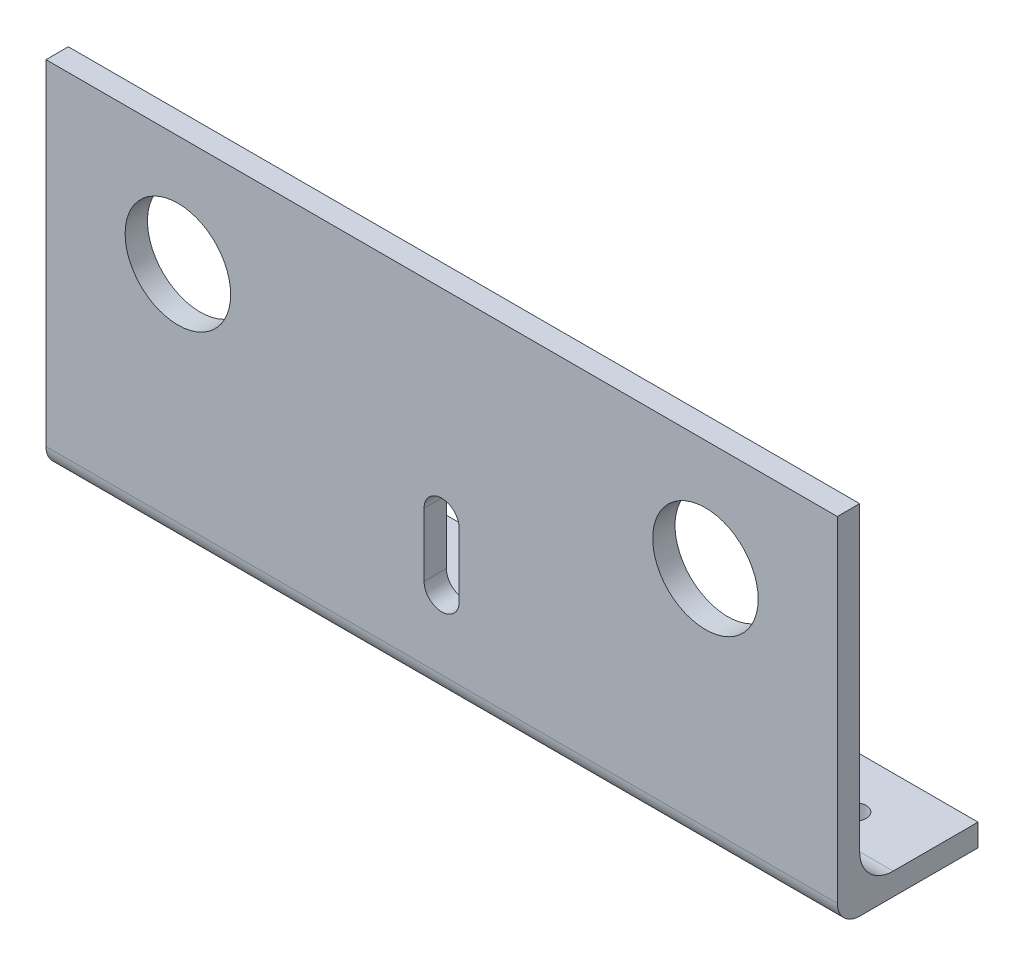
ISO-10303-21;
HEADER;
FILE_DESCRIPTION(('STEP AP214'),'2;1');
FILE_NAME('part.step','',(''),(''),'','','');
FILE_SCHEMA(('AUTOMOTIVE_DESIGN { 1 0 10303 214 1 1 1 1 }'));
ENDSEC;
DATA;
#1=APPLICATION_CONTEXT('core data for automotive mechanical design processes');
#2=APPLICATION_PROTOCOL_DEFINITION('international standard','automotive_design',2000,#1);
#3=PRODUCT_CONTEXT('',#1,'mechanical');
#4=PRODUCT('Part','Part','',(#3));
#5=PRODUCT_RELATED_PRODUCT_CATEGORY('part','',(#4));
#6=PRODUCT_DEFINITION_FORMATION('','',#4);
#7=PRODUCT_DEFINITION_CONTEXT('part definition',#1,'design');
#8=PRODUCT_DEFINITION('design','',#6,#7);
#9=PRODUCT_DEFINITION_SHAPE('','',#8);
#10=(LENGTH_UNIT() NAMED_UNIT(*) SI_UNIT(.MILLI.,.METRE.));
#11=(NAMED_UNIT(*) PLANE_ANGLE_UNIT() SI_UNIT($,.RADIAN.));
#12=(NAMED_UNIT(*) SI_UNIT($,.STERADIAN.) SOLID_ANGLE_UNIT());
#13=UNCERTAINTY_MEASURE_WITH_UNIT(LENGTH_MEASURE(1.E-05),#10,'distance_accuracy_value','');
#14=(GEOMETRIC_REPRESENTATION_CONTEXT(3) GLOBAL_UNCERTAINTY_ASSIGNED_CONTEXT((#13)) GLOBAL_UNIT_ASSIGNED_CONTEXT((#10,
#11,#12)) REPRESENTATION_CONTEXT('',''));
#15=CARTESIAN_POINT('',(0.,0.,0.));
#16=DIRECTION('',(0.,0.,1.));
#17=DIRECTION('',(1.,0.,0.));
#18=AXIS2_PLACEMENT_3D('',#15,#16,#17);
#19=CARTESIAN_POINT('',(225.,0.,-40.));
#20=DIRECTION('',(0.,1.,0.));
#21=DIRECTION('',(0.,0.,1.));
#22=AXIS2_PLACEMENT_3D('',#19,#20,#21);
#23=PLANE('',#22);
#24=CARTESIAN_POINT('',(20.,0.,-25.));
#25=DIRECTION('',(0.,-1.,0.));
#26=DIRECTION('',(0.,0.,-1.));
#27=AXIS2_PLACEMENT_3D('',#24,#25,#26);
#28=CIRCLE('',#27,3.19999999999999);
#29=CARTESIAN_POINT('',(20.,0.,-28.2));
#30=VERTEX_POINT('',#29);
#31=EDGE_CURVE('E494',#30,#30,#28,.T.);
#32=ORIENTED_EDGE('',*,*,#31,.F.);
#33=EDGE_LOOP('',(#32));
#34=FACE_BOUND('',#33,.T.);
#35=CARTESIAN_POINT('',(70.,0.,-25.));
#36=DIRECTION('',(0.,-1.,0.));
#37=DIRECTION('',(0.,0.,-1.));
#38=AXIS2_PLACEMENT_3D('',#35,#36,#37);
#39=CIRCLE('',#38,3.19999999999998);
#40=CARTESIAN_POINT('',(70.,0.,-28.2));
#41=VERTEX_POINT('',#40);
#42=EDGE_CURVE('E499',#41,#41,#39,.T.);
#43=ORIENTED_EDGE('',*,*,#42,.F.);
#44=EDGE_LOOP('',(#43));
#45=FACE_BOUND('',#44,.T.);
#46=CARTESIAN_POINT('',(155.,0.,-25.));
#47=DIRECTION('',(0.,-1.,0.));
#48=DIRECTION('',(0.,0.,-1.));
#49=AXIS2_PLACEMENT_3D('',#46,#47,#48);
#50=CIRCLE('',#49,3.19999999999998);
#51=CARTESIAN_POINT('',(155.,0.,-28.2));
#52=VERTEX_POINT('',#51);
#53=EDGE_CURVE('E511',#52,#52,#50,.T.);
#54=ORIENTED_EDGE('',*,*,#53,.F.);
#55=EDGE_LOOP('',(#54));
#56=FACE_BOUND('',#55,.T.);
#57=CARTESIAN_POINT('',(205.,0.,-25.));
#58=DIRECTION('',(0.,-1.,0.));
#59=DIRECTION('',(0.,0.,-1.));
#60=AXIS2_PLACEMENT_3D('',#57,#58,#59);
#61=CIRCLE('',#60,3.19999999999998);
#62=CARTESIAN_POINT('',(205.,0.,-28.2));
#63=VERTEX_POINT('',#62);
#64=EDGE_CURVE('E519',#63,#63,#61,.T.);
#65=ORIENTED_EDGE('',*,*,#64,.F.);
#66=EDGE_LOOP('',(#65));
#67=FACE_BOUND('',#66,.T.);
#68=DIRECTION('',(0.,0.,-1.));
#69=VECTOR('',#68,1.);
#70=CARTESIAN_POINT('',(225.,0.,-40.));
#71=LINE('',#70,#69);
#72=CARTESIAN_POINT('',(225.,0.,-6.35));
#73=VERTEX_POINT('',#72);
#74=CARTESIAN_POINT('',(225.,0.,-40.));
#75=VERTEX_POINT('',#74);
#76=EDGE_CURVE('E182',#73,#75,#71,.T.);
#77=ORIENTED_EDGE('',*,*,#76,.F.);
#78=DIRECTION('',(-1.,0.,0.));
#79=VECTOR('',#78,1.);
#80=CARTESIAN_POINT('',(225.,0.,-6.35));
#81=LINE('',#80,#79);
#82=CARTESIAN_POINT('',(0.,0.,-6.35));
#83=VERTEX_POINT('',#82);
#84=EDGE_CURVE('E249',#73,#83,#81,.T.);
#85=ORIENTED_EDGE('',*,*,#84,.T.);
#86=DIRECTION('',(0.,0.,-1.));
#87=VECTOR('',#86,1.);
#88=CARTESIAN_POINT('',(0.,0.,-40.));
#89=LINE('',#88,#87);
#90=CARTESIAN_POINT('',(0.,0.,-40.));
#91=VERTEX_POINT('',#90);
#92=EDGE_CURVE('E181',#83,#91,#89,.T.);
#93=ORIENTED_EDGE('',*,*,#92,.T.);
#94=DIRECTION('',(-1.,0.,0.));
#95=VECTOR('',#94,1.);
#96=CARTESIAN_POINT('',(225.,0.,-40.));
#97=LINE('',#96,#95);
#98=EDGE_CURVE('E245',#75,#91,#97,.T.);
#99=ORIENTED_EDGE('',*,*,#98,.F.);
#100=EDGE_LOOP('',(#77,#85,#93,#99));
#101=FACE_BOUND('',#100,.T.);
#102=ADVANCED_FACE('F39',(#34,#45,#56,#67,#101),#23,.F.);
#103=CARTESIAN_POINT('',(225.,6.35,-40.));
#104=DIRECTION('',(0.,0.,1.));
#105=DIRECTION('',(1.,0.,0.));
#106=AXIS2_PLACEMENT_3D('',#103,#104,#105);
#107=PLANE('',#106);
#108=DIRECTION('',(0.,1.,0.));
#109=VECTOR('',#108,1.);
#110=CARTESIAN_POINT('',(0.,6.35,-40.));
#111=LINE('',#110,#109);
#112=CARTESIAN_POINT('',(0.,6.35,-40.));
#113=VERTEX_POINT('',#112);
#114=EDGE_CURVE('E208',#91,#113,#111,.T.);
#115=ORIENTED_EDGE('',*,*,#114,.T.);
#116=DIRECTION('',(-1.,0.,0.));
#117=VECTOR('',#116,1.);
#118=CARTESIAN_POINT('',(225.,6.35,-40.));
#119=LINE('',#118,#117);
#120=CARTESIAN_POINT('',(225.,6.35,-40.));
#121=VERTEX_POINT('',#120);
#122=EDGE_CURVE('E241',#121,#113,#119,.T.);
#123=ORIENTED_EDGE('',*,*,#122,.F.);
#124=DIRECTION('',(0.,1.,0.));
#125=VECTOR('',#124,1.);
#126=CARTESIAN_POINT('',(225.,6.35,-40.));
#127=LINE('',#126,#125);
#128=EDGE_CURVE('E185',#75,#121,#127,.T.);
#129=ORIENTED_EDGE('',*,*,#128,.F.);
#130=ORIENTED_EDGE('',*,*,#98,.T.);
#131=EDGE_LOOP('',(#115,#123,#129,#130));
#132=FACE_BOUND('',#131,.T.);
#133=ADVANCED_FACE('F289',(#132),#107,.F.);
#134=CARTESIAN_POINT('',(225.,6.35,-15.875));
#135=DIRECTION('',(0.,-1.,0.));
#136=DIRECTION('',(0.,0.,-1.));
#137=AXIS2_PLACEMENT_3D('',#134,#135,#136);
#138=PLANE('',#137);
#139=CARTESIAN_POINT('',(20.,6.35,-25.));
#140=DIRECTION('',(0.,-1.,0.));
#141=DIRECTION('',(0.,0.,-1.));
#142=AXIS2_PLACEMENT_3D('',#139,#140,#141);
#143=CIRCLE('',#142,3.19999999999998);
#144=CARTESIAN_POINT('',(20.,6.35,-28.2));
#145=VERTEX_POINT('',#144);
#146=EDGE_CURVE('E497',#145,#145,#143,.T.);
#147=ORIENTED_EDGE('',*,*,#146,.T.);
#148=EDGE_LOOP('',(#147));
#149=FACE_BOUND('',#148,.T.);
#150=CARTESIAN_POINT('',(70.,6.35,-25.));
#151=DIRECTION('',(0.,-1.,0.));
#152=DIRECTION('',(0.,0.,-1.));
#153=AXIS2_PLACEMENT_3D('',#150,#151,#152);
#154=CIRCLE('',#153,3.19999999999998);
#155=CARTESIAN_POINT('',(70.,6.35,-28.2));
#156=VERTEX_POINT('',#155);
#157=EDGE_CURVE('E504',#156,#156,#154,.T.);
#158=ORIENTED_EDGE('',*,*,#157,.T.);
#159=EDGE_LOOP('',(#158));
#160=FACE_BOUND('',#159,.T.);
#161=CARTESIAN_POINT('',(155.,6.35,-25.));
#162=DIRECTION('',(0.,-1.,0.));
#163=DIRECTION('',(0.,0.,-1.));
#164=AXIS2_PLACEMENT_3D('',#161,#162,#163);
#165=CIRCLE('',#164,3.19999999999998);
#166=CARTESIAN_POINT('',(155.,6.35,-28.2));
#167=VERTEX_POINT('',#166);
#168=EDGE_CURVE('E515',#167,#167,#165,.T.);
#169=ORIENTED_EDGE('',*,*,#168,.T.);
#170=EDGE_LOOP('',(#169));
#171=FACE_BOUND('',#170,.T.);
#172=CARTESIAN_POINT('',(205.,6.35,-25.));
#173=DIRECTION('',(0.,-1.,0.));
#174=DIRECTION('',(0.,0.,-1.));
#175=AXIS2_PLACEMENT_3D('',#172,#173,#174);
#176=CIRCLE('',#175,3.19999999999998);
#177=CARTESIAN_POINT('',(205.,6.35,-28.2));
#178=VERTEX_POINT('',#177);
#179=EDGE_CURVE('E43',#178,#178,#176,.T.);
#180=ORIENTED_EDGE('',*,*,#179,.T.);
#181=EDGE_LOOP('',(#180));
#182=FACE_BOUND('',#181,.T.);
#183=DIRECTION('',(0.,0.,1.));
#184=VECTOR('',#183,1.);
#185=CARTESIAN_POINT('',(0.,6.35,-15.875));
#186=LINE('',#185,#184);
#187=CARTESIAN_POINT('',(0.,6.35,-15.875));
#188=VERTEX_POINT('',#187);
#189=EDGE_CURVE('E211',#113,#188,#186,.T.);
#190=ORIENTED_EDGE('',*,*,#189,.T.);
#191=DIRECTION('',(-1.,0.,0.));
#192=VECTOR('',#191,1.);
#193=CARTESIAN_POINT('',(225.,6.35,-15.875));
#194=LINE('',#193,#192);
#195=CARTESIAN_POINT('',(225.,6.35,-15.875));
#196=VERTEX_POINT('',#195);
#197=EDGE_CURVE('E237',#196,#188,#194,.T.);
#198=ORIENTED_EDGE('',*,*,#197,.F.);
#199=DIRECTION('',(0.,0.,1.));
#200=VECTOR('',#199,1.);
#201=CARTESIAN_POINT('',(225.,6.35,-15.875));
#202=LINE('',#201,#200);
#203=EDGE_CURVE('E189',#121,#196,#202,.T.);
#204=ORIENTED_EDGE('',*,*,#203,.F.);
#205=ORIENTED_EDGE('',*,*,#122,.T.);
#206=EDGE_LOOP('',(#190,#198,#204,#205));
#207=FACE_BOUND('',#206,.T.);
#208=ADVANCED_FACE('F294',(#149,#160,#171,#182,#207),#138,.F.);
#209=CARTESIAN_POINT('',(225.,15.875,-15.875));
#210=DIRECTION('',(-1.,0.,0.));
#211=DIRECTION('',(0.,0.,1.));
#212=AXIS2_PLACEMENT_3D('',#209,#210,#211);
#213=CYLINDRICAL_SURFACE('',#212,9.525);
#214=CARTESIAN_POINT('',(0.,15.875,-15.875));
#215=DIRECTION('',(-1.,0.,0.));
#216=DIRECTION('',(0.,0.,-1.));
#217=AXIS2_PLACEMENT_3D('',#214,#215,#216);
#218=CIRCLE('',#217,9.525);
#219=CARTESIAN_POINT('',(0.,15.875,-6.35));
#220=VERTEX_POINT('',#219);
#221=EDGE_CURVE('E214',#188,#220,#218,.T.);
#222=ORIENTED_EDGE('',*,*,#221,.T.);
#223=DIRECTION('',(-1.,0.,0.));
#224=VECTOR('',#223,1.);
#225=CARTESIAN_POINT('',(225.,15.875,-6.35));
#226=LINE('',#225,#224);
#227=CARTESIAN_POINT('',(225.,15.875,-6.35));
#228=VERTEX_POINT('',#227);
#229=EDGE_CURVE('E233',#228,#220,#226,.T.);
#230=ORIENTED_EDGE('',*,*,#229,.F.);
#231=CARTESIAN_POINT('',(225.,15.875,-15.875));
#232=DIRECTION('',(-1.,0.,0.));
#233=DIRECTION('',(0.,0.,-1.));
#234=AXIS2_PLACEMENT_3D('',#231,#232,#233);
#235=CIRCLE('',#234,9.525);
#236=EDGE_CURVE('E192',#196,#228,#235,.T.);
#237=ORIENTED_EDGE('',*,*,#236,.F.);
#238=ORIENTED_EDGE('',*,*,#197,.T.);
#239=EDGE_LOOP('',(#222,#230,#237,#238));
#240=FACE_BOUND('',#239,.T.);
#241=ADVANCED_FACE('F302',(#240),#213,.F.);
#242=CARTESIAN_POINT('',(225.,101.6,-6.35));
#243=DIRECTION('',(0.,0.,1.));
#244=DIRECTION('',(1.,0.,0.));
#245=AXIS2_PLACEMENT_3D('',#242,#243,#244);
#246=PLANE('',#245);
#247=DIRECTION('',(0.,-1.,0.));
#248=VECTOR('',#247,1.);
#249=CARTESIAN_POINT('',(117.5,44.875,-6.35));
#250=LINE('',#249,#248);
#251=CARTESIAN_POINT('',(117.5,44.875,-6.35));
#252=VERTEX_POINT('',#251);
#253=CARTESIAN_POINT('',(117.5,26.875,-6.35));
#254=VERTEX_POINT('',#253);
#255=EDGE_CURVE('E143',#252,#254,#250,.T.);
#256=ORIENTED_EDGE('',*,*,#255,.F.);
#257=CARTESIAN_POINT('',(112.5,44.875,-6.35));
#258=DIRECTION('',(0.,0.,-1.));
#259=DIRECTION('',(-1.,0.,0.));
#260=AXIS2_PLACEMENT_3D('',#257,#258,#259);
#261=CIRCLE('',#260,4.99999999999999);
#262=CARTESIAN_POINT('',(107.5,44.875,-6.35));
#263=VERTEX_POINT('',#262);
#264=EDGE_CURVE('E56',#263,#252,#261,.T.);
#265=ORIENTED_EDGE('',*,*,#264,.F.);
#266=DIRECTION('',(0.,1.,0.));
#267=VECTOR('',#266,1.);
#268=CARTESIAN_POINT('',(107.5,44.875,-6.35));
#269=LINE('',#268,#267);
#270=CARTESIAN_POINT('',(107.5,26.875,-6.35));
#271=VERTEX_POINT('',#270);
#272=EDGE_CURVE('E151',#271,#263,#269,.T.);
#273=ORIENTED_EDGE('',*,*,#272,.F.);
#274=CARTESIAN_POINT('',(112.5,26.875,-6.35));
#275=DIRECTION('',(0.,0.,-1.));
#276=DIRECTION('',(-1.,0.,0.));
#277=AXIS2_PLACEMENT_3D('',#274,#275,#276);
#278=CIRCLE('',#277,5.);
#279=EDGE_CURVE('E133',#254,#271,#278,.T.);
#280=ORIENTED_EDGE('',*,*,#279,.F.);
#281=EDGE_LOOP('',(#256,#265,#273,#280));
#282=FACE_BOUND('',#281,.T.);
#283=CARTESIAN_POINT('',(37.5,70.,-6.34999999999999));
#284=DIRECTION('',(0.,0.,1.));
#285=DIRECTION('',(1.,0.,0.));
#286=AXIS2_PLACEMENT_3D('',#283,#284,#285);
#287=CIRCLE('',#286,15.);
#288=CARTESIAN_POINT('',(52.5,70.,-6.34999999999999));
#289=VERTEX_POINT('',#288);
#290=EDGE_CURVE('E177',#289,#289,#287,.F.);
#291=ORIENTED_EDGE('',*,*,#290,.F.);
#292=EDGE_LOOP('',(#291));
#293=FACE_BOUND('',#292,.T.);
#294=CARTESIAN_POINT('',(187.5,70.,-6.34999999999999));
#295=DIRECTION('',(0.,0.,1.));
#296=DIRECTION('',(1.,0.,0.));
#297=AXIS2_PLACEMENT_3D('',#294,#295,#296);
#298=CIRCLE('',#297,15.);
#299=CARTESIAN_POINT('',(202.5,70.,-6.34999999999999));
#300=VERTEX_POINT('',#299);
#301=EDGE_CURVE('E170',#300,#300,#298,.F.);
#302=ORIENTED_EDGE('',*,*,#301,.F.);
#303=EDGE_LOOP('',(#302));
#304=FACE_BOUND('',#303,.T.);
#305=DIRECTION('',(0.,1.,0.));
#306=VECTOR('',#305,1.);
#307=CARTESIAN_POINT('',(0.,101.6,-6.35));
#308=LINE('',#307,#306);
#309=CARTESIAN_POINT('',(0.,101.6,-6.35));
#310=VERTEX_POINT('',#309);
#311=EDGE_CURVE('E217',#220,#310,#308,.T.);
#312=ORIENTED_EDGE('',*,*,#311,.T.);
#313=DIRECTION('',(-1.,0.,0.));
#314=VECTOR('',#313,1.);
#315=CARTESIAN_POINT('',(225.,101.6,-6.35));
#316=LINE('',#315,#314);
#317=CARTESIAN_POINT('',(225.,101.6,-6.35));
#318=VERTEX_POINT('',#317);
#319=EDGE_CURVE('E229',#318,#310,#316,.T.);
#320=ORIENTED_EDGE('',*,*,#319,.F.);
#321=DIRECTION('',(0.,1.,0.));
#322=VECTOR('',#321,1.);
#323=CARTESIAN_POINT('',(225.,101.6,-6.35));
#324=LINE('',#323,#322);
#325=EDGE_CURVE('E195',#228,#318,#324,.T.);
#326=ORIENTED_EDGE('',*,*,#325,.F.);
#327=ORIENTED_EDGE('',*,*,#229,.T.);
#328=EDGE_LOOP('',(#312,#320,#326,#327));
#329=FACE_BOUND('',#328,.T.);
#330=ADVANCED_FACE('F148',(#282,#293,#304,#329),#246,.F.);
#331=CARTESIAN_POINT('',(225.,101.6,0.));
#332=DIRECTION('',(0.,-1.,0.));
#333=DIRECTION('',(0.,0.,-1.));
#334=AXIS2_PLACEMENT_3D('',#331,#332,#333);
#335=PLANE('',#334);
#336=DIRECTION('',(0.,0.,1.));
#337=VECTOR('',#336,1.);
#338=CARTESIAN_POINT('',(0.,101.6,0.));
#339=LINE('',#338,#337);
#340=CARTESIAN_POINT('',(0.,101.6,0.));
#341=VERTEX_POINT('',#340);
#342=EDGE_CURVE('E220',#310,#341,#339,.T.);
#343=ORIENTED_EDGE('',*,*,#342,.T.);
#344=DIRECTION('',(-1.,0.,0.));
#345=VECTOR('',#344,1.);
#346=CARTESIAN_POINT('',(225.,101.6,0.));
#347=LINE('',#346,#345);
#348=CARTESIAN_POINT('',(225.,101.6,0.));
#349=VERTEX_POINT('',#348);
#350=EDGE_CURVE('E205',#349,#341,#347,.T.);
#351=ORIENTED_EDGE('',*,*,#350,.F.);
#352=DIRECTION('',(0.,0.,1.));
#353=VECTOR('',#352,1.);
#354=CARTESIAN_POINT('',(225.,101.6,0.));
#355=LINE('',#354,#353);
#356=EDGE_CURVE('E198',#318,#349,#355,.T.);
#357=ORIENTED_EDGE('',*,*,#356,.F.);
#358=ORIENTED_EDGE('',*,*,#319,.T.);
#359=EDGE_LOOP('',(#343,#351,#357,#358));
#360=FACE_BOUND('',#359,.T.);
#361=ADVANCED_FACE('F309',(#360),#335,.F.);
#362=CARTESIAN_POINT('',(225.,0.,0.));
#363=DIRECTION('',(0.,0.,-1.));
#364=DIRECTION('',(-1.,0.,0.));
#365=AXIS2_PLACEMENT_3D('',#362,#363,#364);
#366=PLANE('',#365);
#367=DIRECTION('',(0.,1.,0.));
#368=VECTOR('',#367,1.);
#369=CARTESIAN_POINT('',(107.5,0.,0.));
#370=LINE('',#369,#368);
#371=CARTESIAN_POINT('',(107.5,26.875,0.));
#372=VERTEX_POINT('',#371);
#373=CARTESIAN_POINT('',(107.5,44.875,0.));
#374=VERTEX_POINT('',#373);
#375=EDGE_CURVE('E49',#372,#374,#370,.T.);
#376=ORIENTED_EDGE('',*,*,#375,.T.);
#377=CARTESIAN_POINT('',(112.5,44.875,0.));
#378=DIRECTION('',(0.,0.,-1.));
#379=DIRECTION('',(-1.,0.,0.));
#380=AXIS2_PLACEMENT_3D('',#377,#378,#379);
#381=CIRCLE('',#380,4.99999999999999);
#382=CARTESIAN_POINT('',(117.5,44.875,0.));
#383=VERTEX_POINT('',#382);
#384=EDGE_CURVE('E11',#374,#383,#381,.T.);
#385=ORIENTED_EDGE('',*,*,#384,.T.);
#386=DIRECTION('',(0.,-1.,0.));
#387=VECTOR('',#386,1.);
#388=CARTESIAN_POINT('',(117.5,0.,0.));
#389=LINE('',#388,#387);
#390=CARTESIAN_POINT('',(117.5,26.875,0.));
#391=VERTEX_POINT('',#390);
#392=EDGE_CURVE('E262',#383,#391,#389,.T.);
#393=ORIENTED_EDGE('',*,*,#392,.T.);
#394=CARTESIAN_POINT('',(112.5,26.875,0.));
#395=DIRECTION('',(0.,0.,-1.));
#396=DIRECTION('',(-1.,0.,0.));
#397=AXIS2_PLACEMENT_3D('',#394,#395,#396);
#398=CIRCLE('',#397,5.);
#399=EDGE_CURVE('E136',#391,#372,#398,.T.);
#400=ORIENTED_EDGE('',*,*,#399,.T.);
#401=EDGE_LOOP('',(#376,#385,#393,#400));
#402=FACE_BOUND('',#401,.T.);
#403=CARTESIAN_POINT('',(37.5,70.,0.));
#404=DIRECTION('',(0.,0.,-1.));
#405=DIRECTION('',(-1.,0.,0.));
#406=AXIS2_PLACEMENT_3D('',#403,#404,#405);
#407=CIRCLE('',#406,15.);
#408=CARTESIAN_POINT('',(22.5,70.,0.));
#409=VERTEX_POINT('',#408);
#410=EDGE_CURVE('E166',#409,#409,#407,.T.);
#411=ORIENTED_EDGE('',*,*,#410,.T.);
#412=EDGE_LOOP('',(#411));
#413=FACE_BOUND('',#412,.T.);
#414=CARTESIAN_POINT('',(187.5,70.,0.));
#415=DIRECTION('',(0.,0.,-1.));
#416=DIRECTION('',(1.,0.,0.));
#417=AXIS2_PLACEMENT_3D('',#414,#415,#416);
#418=CIRCLE('',#417,15.);
#419=CARTESIAN_POINT('',(202.5,70.,0.));
#420=VERTEX_POINT('',#419);
#421=EDGE_CURVE('E161',#420,#420,#418,.T.);
#422=ORIENTED_EDGE('',*,*,#421,.T.);
#423=EDGE_LOOP('',(#422));
#424=FACE_BOUND('',#423,.T.);
#425=DIRECTION('',(0.,-1.,0.));
#426=VECTOR('',#425,1.);
#427=CARTESIAN_POINT('',(0.,0.,0.));
#428=LINE('',#427,#426);
#429=CARTESIAN_POINT('',(0.,6.35,0.));
#430=VERTEX_POINT('',#429);
#431=EDGE_CURVE('E186',#341,#430,#428,.T.);
#432=ORIENTED_EDGE('',*,*,#431,.T.);
#433=DIRECTION('',(-1.,0.,0.));
#434=VECTOR('',#433,1.);
#435=CARTESIAN_POINT('',(225.,6.35,0.));
#436=LINE('',#435,#434);
#437=CARTESIAN_POINT('',(225.,6.35,0.));
#438=VERTEX_POINT('',#437);
#439=EDGE_CURVE('E256',#430,#438,#436,.F.);
#440=ORIENTED_EDGE('',*,*,#439,.T.);
#441=DIRECTION('',(0.,-1.,0.));
#442=VECTOR('',#441,1.);
#443=CARTESIAN_POINT('',(225.,0.,0.));
#444=LINE('',#443,#442);
#445=EDGE_CURVE('E201',#349,#438,#444,.T.);
#446=ORIENTED_EDGE('',*,*,#445,.F.);
#447=ORIENTED_EDGE('',*,*,#350,.T.);
#448=EDGE_LOOP('',(#432,#440,#446,#447));
#449=FACE_BOUND('',#448,.T.);
#450=ADVANCED_FACE('F270',(#402,#413,#424,#449),#366,.F.);
#451=CARTESIAN_POINT('',(225.,15.875,-15.875));
#452=DIRECTION('',(1.,0.,0.));
#453=DIRECTION('',(0.,0.,-1.));
#454=AXIS2_PLACEMENT_3D('',#451,#452,#453);
#455=PLANE('',#454);
#456=ORIENTED_EDGE('',*,*,#445,.T.);
#457=CARTESIAN_POINT('',(225.,6.35,-6.35));
#458=DIRECTION('',(1.,0.,0.));
#459=DIRECTION('',(0.,0.,-1.));
#460=AXIS2_PLACEMENT_3D('',#457,#458,#459);
#461=CIRCLE('',#460,6.35);
#462=EDGE_CURVE('E259',#438,#73,#461,.T.);
#463=ORIENTED_EDGE('',*,*,#462,.T.);
#464=ORIENTED_EDGE('',*,*,#76,.T.);
#465=ORIENTED_EDGE('',*,*,#128,.T.);
#466=ORIENTED_EDGE('',*,*,#203,.T.);
#467=ORIENTED_EDGE('',*,*,#236,.T.);
#468=ORIENTED_EDGE('',*,*,#325,.T.);
#469=ORIENTED_EDGE('',*,*,#356,.T.);
#470=EDGE_LOOP('',(#456,#463,#464,#465,#466,#467,#468,#469));
#471=FACE_BOUND('',#470,.T.);
#472=ADVANCED_FACE('F315',(#471),#455,.T.);
#473=CARTESIAN_POINT('',(0.,15.875,-15.875));
#474=DIRECTION('',(1.,0.,0.));
#475=DIRECTION('',(0.,0.,-1.));
#476=AXIS2_PLACEMENT_3D('',#473,#474,#475);
#477=PLANE('',#476);
#478=ORIENTED_EDGE('',*,*,#92,.F.);
#479=CARTESIAN_POINT('',(0.,6.35,-6.35));
#480=DIRECTION('',(1.,0.,0.));
#481=DIRECTION('',(0.,0.,-1.));
#482=AXIS2_PLACEMENT_3D('',#479,#480,#481);
#483=CIRCLE('',#482,6.35);
#484=EDGE_CURVE('E253',#83,#430,#483,.F.);
#485=ORIENTED_EDGE('',*,*,#484,.T.);
#486=ORIENTED_EDGE('',*,*,#431,.F.);
#487=ORIENTED_EDGE('',*,*,#342,.F.);
#488=ORIENTED_EDGE('',*,*,#311,.F.);
#489=ORIENTED_EDGE('',*,*,#221,.F.);
#490=ORIENTED_EDGE('',*,*,#189,.F.);
#491=ORIENTED_EDGE('',*,*,#114,.F.);
#492=EDGE_LOOP('',(#478,#485,#486,#487,#488,#489,#490,#491));
#493=FACE_BOUND('',#492,.T.);
#494=ADVANCED_FACE('F316',(#493),#477,.F.);
#495=CARTESIAN_POINT('',(225.,6.35,-6.35));
#496=DIRECTION('',(-1.,0.,0.));
#497=DIRECTION('',(0.,0.,1.));
#498=AXIS2_PLACEMENT_3D('',#495,#496,#497);
#499=CYLINDRICAL_SURFACE('',#498,6.35);
#500=ORIENTED_EDGE('',*,*,#462,.F.);
#501=ORIENTED_EDGE('',*,*,#439,.F.);
#502=ORIENTED_EDGE('',*,*,#484,.F.);
#503=ORIENTED_EDGE('',*,*,#84,.F.);
#504=EDGE_LOOP('',(#500,#501,#502,#503));
#505=FACE_BOUND('',#504,.T.);
#506=ADVANCED_FACE('F41',(#505),#499,.T.);
#507=CARTESIAN_POINT('',(187.5,70.,-75.));
#508=DIRECTION('',(0.,0.,1.));
#509=DIRECTION('',(1.,0.,0.));
#510=AXIS2_PLACEMENT_3D('',#507,#508,#509);
#511=CYLINDRICAL_SURFACE('',#510,15.);
#512=ORIENTED_EDGE('',*,*,#421,.F.);
#513=EDGE_LOOP('',(#512));
#514=FACE_BOUND('',#513,.T.);
#515=ORIENTED_EDGE('',*,*,#301,.T.);
#516=EDGE_LOOP('',(#515));
#517=FACE_BOUND('',#516,.T.);
#518=ADVANCED_FACE('F284',(#514,#517),#511,.F.);
#519=CARTESIAN_POINT('',(37.5,70.,-75.));
#520=DIRECTION('',(0.,0.,1.));
#521=DIRECTION('',(1.,0.,0.));
#522=AXIS2_PLACEMENT_3D('',#519,#520,#521);
#523=CYLINDRICAL_SURFACE('',#522,15.);
#524=ORIENTED_EDGE('',*,*,#410,.F.);
#525=EDGE_LOOP('',(#524));
#526=FACE_BOUND('',#525,.T.);
#527=ORIENTED_EDGE('',*,*,#290,.T.);
#528=EDGE_LOOP('',(#527));
#529=FACE_BOUND('',#528,.T.);
#530=ADVANCED_FACE('F277',(#526,#529),#523,.F.);
#531=CARTESIAN_POINT('',(112.5,44.875,3.65));
#532=DIRECTION('',(0.,0.,-1.));
#533=DIRECTION('',(-1.,0.,0.));
#534=AXIS2_PLACEMENT_3D('',#531,#532,#533);
#535=CYLINDRICAL_SURFACE('',#534,4.99999999999999);
#536=DIRECTION('',(0.,0.,-1.));
#537=VECTOR('',#536,1.);
#538=CARTESIAN_POINT('',(107.5,44.875,3.65));
#539=LINE('',#538,#537);
#540=EDGE_CURVE('E158',#374,#263,#539,.T.);
#541=ORIENTED_EDGE('',*,*,#540,.T.);
#542=ORIENTED_EDGE('',*,*,#264,.T.);
#543=DIRECTION('',(0.,0.,-1.));
#544=VECTOR('',#543,1.);
#545=CARTESIAN_POINT('',(117.5,44.875,3.65));
#546=LINE('',#545,#544);
#547=EDGE_CURVE('E140',#383,#252,#546,.T.);
#548=ORIENTED_EDGE('',*,*,#547,.F.);
#549=ORIENTED_EDGE('',*,*,#384,.F.);
#550=EDGE_LOOP('',(#541,#542,#548,#549));
#551=FACE_BOUND('',#550,.T.);
#552=ADVANCED_FACE('F275',(#551),#535,.F.);
#553=CARTESIAN_POINT('',(107.5,44.875,3.65));
#554=DIRECTION('',(-1.,0.,0.));
#555=DIRECTION('',(0.,-1.,0.));
#556=AXIS2_PLACEMENT_3D('',#553,#554,#555);
#557=PLANE('',#556);
#558=DIRECTION('',(0.,0.,-1.));
#559=VECTOR('',#558,1.);
#560=CARTESIAN_POINT('',(107.5,26.875,3.65));
#561=LINE('',#560,#559);
#562=EDGE_CURVE('E139',#372,#271,#561,.T.);
#563=ORIENTED_EDGE('',*,*,#562,.T.);
#564=ORIENTED_EDGE('',*,*,#272,.T.);
#565=ORIENTED_EDGE('',*,*,#540,.F.);
#566=ORIENTED_EDGE('',*,*,#375,.F.);
#567=EDGE_LOOP('',(#563,#564,#565,#566));
#568=FACE_BOUND('',#567,.T.);
#569=ADVANCED_FACE('F274',(#568),#557,.F.);
#570=CARTESIAN_POINT('',(112.5,26.875,3.65));
#571=DIRECTION('',(0.,0.,-1.));
#572=DIRECTION('',(-1.,0.,0.));
#573=AXIS2_PLACEMENT_3D('',#570,#571,#572);
#574=CYLINDRICAL_SURFACE('',#573,5.);
#575=DIRECTION('',(0.,0.,-1.));
#576=VECTOR('',#575,1.);
#577=CARTESIAN_POINT('',(117.5,26.875,3.65));
#578=LINE('',#577,#576);
#579=EDGE_CURVE('E64',#391,#254,#578,.T.);
#580=ORIENTED_EDGE('',*,*,#579,.T.);
#581=ORIENTED_EDGE('',*,*,#279,.T.);
#582=ORIENTED_EDGE('',*,*,#562,.F.);
#583=ORIENTED_EDGE('',*,*,#399,.F.);
#584=EDGE_LOOP('',(#580,#581,#582,#583));
#585=FACE_BOUND('',#584,.T.);
#586=ADVANCED_FACE('F130',(#585),#574,.F.);
#587=CARTESIAN_POINT('',(117.5,44.875,3.65));
#588=DIRECTION('',(1.,0.,0.));
#589=DIRECTION('',(0.,1.,0.));
#590=AXIS2_PLACEMENT_3D('',#587,#588,#589);
#591=PLANE('',#590);
#592=ORIENTED_EDGE('',*,*,#547,.T.);
#593=ORIENTED_EDGE('',*,*,#255,.T.);
#594=ORIENTED_EDGE('',*,*,#579,.F.);
#595=ORIENTED_EDGE('',*,*,#392,.F.);
#596=EDGE_LOOP('',(#592,#593,#594,#595));
#597=FACE_BOUND('',#596,.T.);
#598=ADVANCED_FACE('F144',(#597),#591,.F.);
#599=CARTESIAN_POINT('',(205.,0.,-25.));
#600=DIRECTION('',(0.,-1.,0.));
#601=DIRECTION('',(0.,0.,-1.));
#602=AXIS2_PLACEMENT_3D('',#599,#600,#601);
#603=CYLINDRICAL_SURFACE('',#602,3.19999999999998);
#604=ORIENTED_EDGE('',*,*,#64,.T.);
#605=EDGE_LOOP('',(#604));
#606=FACE_BOUND('',#605,.T.);
#607=ORIENTED_EDGE('',*,*,#179,.F.);
#608=EDGE_LOOP('',(#607));
#609=FACE_BOUND('',#608,.T.);
#610=ADVANCED_FACE('F450',(#606,#609),#603,.F.);
#611=CARTESIAN_POINT('',(155.,0.,-25.));
#612=DIRECTION('',(0.,-1.,0.));
#613=DIRECTION('',(0.,0.,-1.));
#614=AXIS2_PLACEMENT_3D('',#611,#612,#613);
#615=CYLINDRICAL_SURFACE('',#614,3.19999999999998);
#616=ORIENTED_EDGE('',*,*,#53,.T.);
#617=EDGE_LOOP('',(#616));
#618=FACE_BOUND('',#617,.T.);
#619=ORIENTED_EDGE('',*,*,#168,.F.);
#620=EDGE_LOOP('',(#619));
#621=FACE_BOUND('',#620,.T.);
#622=ADVANCED_FACE('F456',(#618,#621),#615,.F.);
#623=CARTESIAN_POINT('',(70.,0.,-25.));
#624=DIRECTION('',(0.,-1.,0.));
#625=DIRECTION('',(0.,0.,-1.));
#626=AXIS2_PLACEMENT_3D('',#623,#624,#625);
#627=CYLINDRICAL_SURFACE('',#626,3.19999999999998);
#628=ORIENTED_EDGE('',*,*,#42,.T.);
#629=EDGE_LOOP('',(#628));
#630=FACE_BOUND('',#629,.T.);
#631=ORIENTED_EDGE('',*,*,#157,.F.);
#632=EDGE_LOOP('',(#631));
#633=FACE_BOUND('',#632,.T.);
#634=ADVANCED_FACE('F465',(#630,#633),#627,.F.);
#635=CARTESIAN_POINT('',(20.,0.,-25.));
#636=DIRECTION('',(0.,-1.,0.));
#637=DIRECTION('',(0.,0.,-1.));
#638=AXIS2_PLACEMENT_3D('',#635,#636,#637);
#639=CYLINDRICAL_SURFACE('',#638,3.19999999999998);
#640=ORIENTED_EDGE('',*,*,#31,.T.);
#641=EDGE_LOOP('',(#640));
#642=FACE_BOUND('',#641,.T.);
#643=ORIENTED_EDGE('',*,*,#146,.F.);
#644=EDGE_LOOP('',(#643));
#645=FACE_BOUND('',#644,.T.);
#646=ADVANCED_FACE('F474',(#642,#645),#639,.F.);
#647=CLOSED_SHELL('',(#102,#133,#208,#241,#330,#361,#450,#472,#494,#506,#518,#530,#552,#569,
#586,#598,#610,#622,#634,#646));
#648=MANIFOLD_SOLID_BREP('B2',#647);
#649=ADVANCED_BREP_SHAPE_REPRESENTATION('',(#18,#648),#14);
#650=SHAPE_DEFINITION_REPRESENTATION(#9,#649);
ENDSEC;
END-ISO-10303-21;
